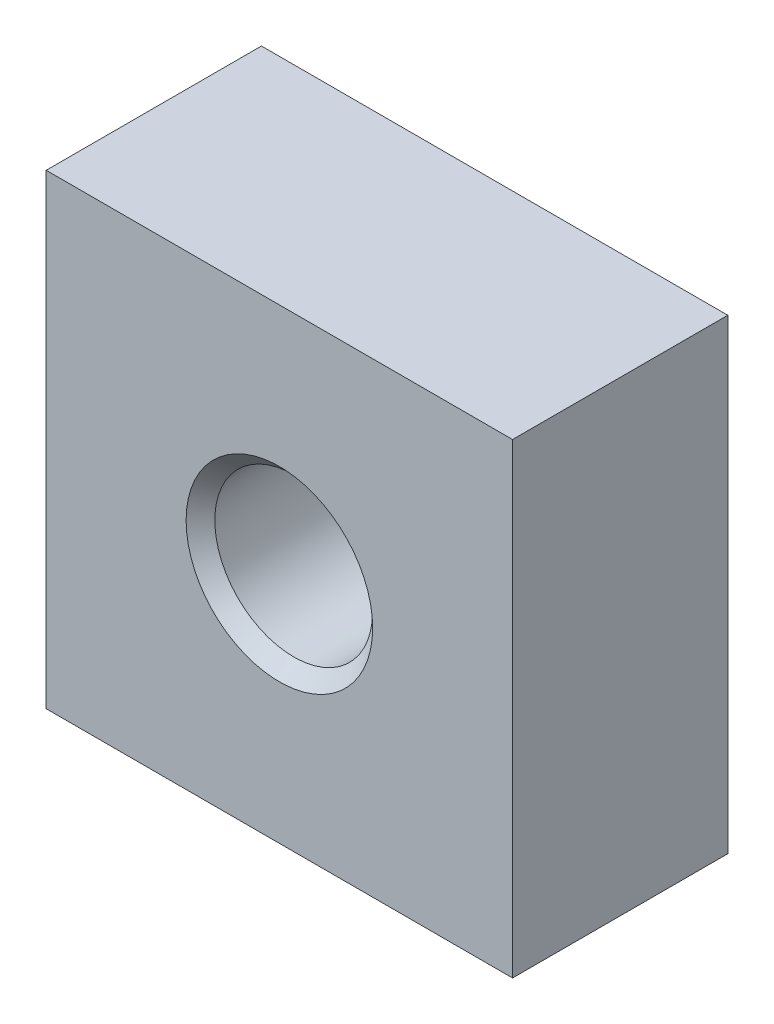
ISO-10303-21;
HEADER;
FILE_DESCRIPTION(('STEP AP214'),'2;1');
FILE_NAME('part.step','',(''),(''),'','','');
FILE_SCHEMA(('AUTOMOTIVE_DESIGN { 1 0 10303 214 1 1 1 1 }'));
ENDSEC;
DATA;
#1=APPLICATION_CONTEXT('core data for automotive mechanical design processes');
#2=APPLICATION_PROTOCOL_DEFINITION('international standard','automotive_design',2000,#1);
#3=PRODUCT_CONTEXT('',#1,'mechanical');
#4=PRODUCT('Part','Part','',(#3));
#5=PRODUCT_RELATED_PRODUCT_CATEGORY('part','',(#4));
#6=PRODUCT_DEFINITION_FORMATION('','',#4);
#7=PRODUCT_DEFINITION_CONTEXT('part definition',#1,'design');
#8=PRODUCT_DEFINITION('design','',#6,#7);
#9=PRODUCT_DEFINITION_SHAPE('','',#8);
#10=(LENGTH_UNIT() NAMED_UNIT(*) SI_UNIT(.MILLI.,.METRE.));
#11=(NAMED_UNIT(*) PLANE_ANGLE_UNIT() SI_UNIT($,.RADIAN.));
#12=(NAMED_UNIT(*) SI_UNIT($,.STERADIAN.) SOLID_ANGLE_UNIT());
#13=UNCERTAINTY_MEASURE_WITH_UNIT(LENGTH_MEASURE(1.E-05),#10,'distance_accuracy_value','');
#14=(GEOMETRIC_REPRESENTATION_CONTEXT(3) GLOBAL_UNCERTAINTY_ASSIGNED_CONTEXT((#13)) GLOBAL_UNIT_ASSIGNED_CONTEXT((#10,
#11,#12)) REPRESENTATION_CONTEXT('',''));
#15=CARTESIAN_POINT('',(0.,0.,0.));
#16=DIRECTION('',(0.,0.,1.));
#17=DIRECTION('',(1.,0.,0.));
#18=AXIS2_PLACEMENT_3D('',#15,#16,#17);
#19=CARTESIAN_POINT('',(0.,0.,30.));
#20=DIRECTION('',(0.,0.,1.));
#21=DIRECTION('',(1.,0.,0.));
#22=AXIS2_PLACEMENT_3D('',#19,#20,#21);
#23=PLANE('',#22);
#24=CARTESIAN_POINT('',(0.,0.,30.));
#25=DIRECTION('',(0.,0.,1.));
#26=DIRECTION('',(1.,0.,0.));
#27=AXIS2_PLACEMENT_3D('',#24,#25,#26);
#28=CIRCLE('',#27,13.);
#29=CARTESIAN_POINT('',(13.,0.,30.));
#30=VERTEX_POINT('',#29);
#31=EDGE_CURVE('E11',#30,#30,#28,.F.);
#32=ORIENTED_EDGE('',*,*,#31,.T.);
#33=EDGE_LOOP('',(#32));
#34=FACE_BOUND('',#33,.T.);
#35=DIRECTION('',(0.,-1.,0.));
#36=VECTOR('',#35,1.);
#37=CARTESIAN_POINT('',(-32.5,-32.5,30.));
#38=LINE('',#37,#36);
#39=CARTESIAN_POINT('',(-32.5,32.5,30.));
#40=VERTEX_POINT('',#39);
#41=CARTESIAN_POINT('',(-32.5,-32.5,30.));
#42=VERTEX_POINT('',#41);
#43=EDGE_CURVE('E87',#40,#42,#38,.T.);
#44=ORIENTED_EDGE('',*,*,#43,.T.);
#45=DIRECTION('',(1.,0.,0.));
#46=VECTOR('',#45,1.);
#47=CARTESIAN_POINT('',(32.5,-32.5,30.));
#48=LINE('',#47,#46);
#49=CARTESIAN_POINT('',(32.5,-32.5,30.));
#50=VERTEX_POINT('',#49);
#51=EDGE_CURVE('E83',#42,#50,#48,.T.);
#52=ORIENTED_EDGE('',*,*,#51,.T.);
#53=DIRECTION('',(0.,1.,0.));
#54=VECTOR('',#53,1.);
#55=CARTESIAN_POINT('',(32.5,-32.5,30.));
#56=LINE('',#55,#54);
#57=CARTESIAN_POINT('',(32.5,32.5,30.));
#58=VERTEX_POINT('',#57);
#59=EDGE_CURVE('E85',#50,#58,#56,.T.);
#60=ORIENTED_EDGE('',*,*,#59,.T.);
#61=DIRECTION('',(-1.,0.,0.));
#62=VECTOR('',#61,1.);
#63=CARTESIAN_POINT('',(32.5,32.5,30.));
#64=LINE('',#63,#62);
#65=EDGE_CURVE('E52',#58,#40,#64,.T.);
#66=ORIENTED_EDGE('',*,*,#65,.T.);
#67=EDGE_LOOP('',(#44,#52,#60,#66));
#68=FACE_BOUND('',#67,.T.);
#69=ADVANCED_FACE('F35',(#34,#68),#23,.T.);
#70=CARTESIAN_POINT('',(0.,0.,0.));
#71=DIRECTION('',(0.,0.,1.));
#72=DIRECTION('',(1.,0.,0.));
#73=AXIS2_PLACEMENT_3D('',#70,#71,#72);
#74=PLANE('',#73);
#75=CARTESIAN_POINT('',(0.,0.,0.));
#76=DIRECTION('',(0.,0.,1.));
#77=DIRECTION('',(1.,0.,0.));
#78=AXIS2_PLACEMENT_3D('',#75,#76,#77);
#79=CIRCLE('',#78,13.);
#80=CARTESIAN_POINT('',(13.,0.,0.));
#81=VERTEX_POINT('',#80);
#82=EDGE_CURVE('E111',#81,#81,#79,.T.);
#83=ORIENTED_EDGE('',*,*,#82,.T.);
#84=EDGE_LOOP('',(#83));
#85=FACE_BOUND('',#84,.T.);
#86=DIRECTION('',(0.,-1.,0.));
#87=VECTOR('',#86,1.);
#88=CARTESIAN_POINT('',(-32.5,-32.5,0.));
#89=LINE('',#88,#87);
#90=CARTESIAN_POINT('',(-32.5,32.5,0.));
#91=VERTEX_POINT('',#90);
#92=CARTESIAN_POINT('',(-32.5,-32.5,0.));
#93=VERTEX_POINT('',#92);
#94=EDGE_CURVE('E102',#91,#93,#89,.T.);
#95=ORIENTED_EDGE('',*,*,#94,.F.);
#96=DIRECTION('',(-1.,0.,0.));
#97=VECTOR('',#96,1.);
#98=CARTESIAN_POINT('',(32.5,32.5,0.));
#99=LINE('',#98,#97);
#100=CARTESIAN_POINT('',(32.5,32.5,0.));
#101=VERTEX_POINT('',#100);
#102=EDGE_CURVE('E75',#101,#91,#99,.T.);
#103=ORIENTED_EDGE('',*,*,#102,.F.);
#104=DIRECTION('',(0.,1.,0.));
#105=VECTOR('',#104,1.);
#106=CARTESIAN_POINT('',(32.5,-32.5,0.));
#107=LINE('',#106,#105);
#108=CARTESIAN_POINT('',(32.5,-32.5,0.));
#109=VERTEX_POINT('',#108);
#110=EDGE_CURVE('E69',#109,#101,#107,.T.);
#111=ORIENTED_EDGE('',*,*,#110,.F.);
#112=DIRECTION('',(1.,0.,0.));
#113=VECTOR('',#112,1.);
#114=CARTESIAN_POINT('',(32.5,-32.5,0.));
#115=LINE('',#114,#113);
#116=EDGE_CURVE('E92',#93,#109,#115,.T.);
#117=ORIENTED_EDGE('',*,*,#116,.F.);
#118=EDGE_LOOP('',(#95,#103,#111,#117));
#119=FACE_BOUND('',#118,.T.);
#120=ADVANCED_FACE('F127',(#85,#119),#74,.F.);
#121=CARTESIAN_POINT('',(-32.5,-32.5,30.));
#122=DIRECTION('',(1.,0.,0.));
#123=DIRECTION('',(0.,0.,-1.));
#124=AXIS2_PLACEMENT_3D('',#121,#122,#123);
#125=PLANE('',#124);
#126=ORIENTED_EDGE('',*,*,#94,.T.);
#127=DIRECTION('',(0.,0.,-1.));
#128=VECTOR('',#127,1.);
#129=CARTESIAN_POINT('',(-32.5,-32.5,30.));
#130=LINE('',#129,#128);
#131=EDGE_CURVE('E93',#42,#93,#130,.T.);
#132=ORIENTED_EDGE('',*,*,#131,.F.);
#133=ORIENTED_EDGE('',*,*,#43,.F.);
#134=DIRECTION('',(0.,0.,-1.));
#135=VECTOR('',#134,1.);
#136=CARTESIAN_POINT('',(-32.5,32.5,30.));
#137=LINE('',#136,#135);
#138=EDGE_CURVE('E98',#40,#91,#137,.T.);
#139=ORIENTED_EDGE('',*,*,#138,.T.);
#140=EDGE_LOOP('',(#126,#132,#133,#139));
#141=FACE_BOUND('',#140,.T.);
#142=ADVANCED_FACE('F130',(#141),#125,.F.);
#143=CARTESIAN_POINT('',(32.5,-32.5,30.));
#144=DIRECTION('',(0.,1.,0.));
#145=DIRECTION('',(0.,0.,1.));
#146=AXIS2_PLACEMENT_3D('',#143,#144,#145);
#147=PLANE('',#146);
#148=ORIENTED_EDGE('',*,*,#116,.T.);
#149=DIRECTION('',(0.,0.,-1.));
#150=VECTOR('',#149,1.);
#151=CARTESIAN_POINT('',(32.5,-32.5,30.));
#152=LINE('',#151,#150);
#153=EDGE_CURVE('E90',#50,#109,#152,.T.);
#154=ORIENTED_EDGE('',*,*,#153,.F.);
#155=ORIENTED_EDGE('',*,*,#51,.F.);
#156=ORIENTED_EDGE('',*,*,#131,.T.);
#157=EDGE_LOOP('',(#148,#154,#155,#156));
#158=FACE_BOUND('',#157,.T.);
#159=ADVANCED_FACE('F91',(#158),#147,.F.);
#160=CARTESIAN_POINT('',(32.5,-32.5,30.));
#161=DIRECTION('',(-1.,0.,0.));
#162=DIRECTION('',(0.,0.,1.));
#163=AXIS2_PLACEMENT_3D('',#160,#161,#162);
#164=PLANE('',#163);
#165=ORIENTED_EDGE('',*,*,#110,.T.);
#166=DIRECTION('',(0.,0.,-1.));
#167=VECTOR('',#166,1.);
#168=CARTESIAN_POINT('',(32.5,32.5,30.));
#169=LINE('',#168,#167);
#170=EDGE_CURVE('E94',#58,#101,#169,.T.);
#171=ORIENTED_EDGE('',*,*,#170,.F.);
#172=ORIENTED_EDGE('',*,*,#59,.F.);
#173=ORIENTED_EDGE('',*,*,#153,.T.);
#174=EDGE_LOOP('',(#165,#171,#172,#173));
#175=FACE_BOUND('',#174,.T.);
#176=ADVANCED_FACE('F96',(#175),#164,.F.);
#177=CARTESIAN_POINT('',(32.5,32.5,30.));
#178=DIRECTION('',(0.,-1.,0.));
#179=DIRECTION('',(1.,0.,0.));
#180=AXIS2_PLACEMENT_3D('',#177,#178,#179);
#181=PLANE('',#180);
#182=ORIENTED_EDGE('',*,*,#102,.T.);
#183=ORIENTED_EDGE('',*,*,#138,.F.);
#184=ORIENTED_EDGE('',*,*,#65,.F.);
#185=ORIENTED_EDGE('',*,*,#170,.T.);
#186=EDGE_LOOP('',(#182,#183,#184,#185));
#187=FACE_BOUND('',#186,.T.);
#188=ADVANCED_FACE('F134',(#187),#181,.F.);
#189=CARTESIAN_POINT('',(0.,0.,30.));
#190=DIRECTION('',(0.,0.,-1.));
#191=DIRECTION('',(-1.,0.,0.));
#192=AXIS2_PLACEMENT_3D('',#189,#190,#191);
#193=CYLINDRICAL_SURFACE('',#192,11.);
#194=CARTESIAN_POINT('',(0.,0.,2.));
#195=DIRECTION('',(0.,0.,1.));
#196=DIRECTION('',(1.,0.,0.));
#197=AXIS2_PLACEMENT_3D('',#194,#195,#196);
#198=CIRCLE('',#197,11.);
#199=CARTESIAN_POINT('',(11.,0.,2.));
#200=VERTEX_POINT('',#199);
#201=EDGE_CURVE('E44',#200,#200,#198,.F.);
#202=ORIENTED_EDGE('',*,*,#201,.T.);
#203=EDGE_LOOP('',(#202));
#204=FACE_BOUND('',#203,.T.);
#205=CARTESIAN_POINT('',(0.,0.,28.));
#206=DIRECTION('',(0.,0.,1.));
#207=DIRECTION('',(1.,0.,0.));
#208=AXIS2_PLACEMENT_3D('',#205,#206,#207);
#209=CIRCLE('',#208,11.);
#210=CARTESIAN_POINT('',(11.,0.,28.));
#211=VERTEX_POINT('',#210);
#212=EDGE_CURVE('E114',#211,#211,#209,.T.);
#213=ORIENTED_EDGE('',*,*,#212,.T.);
#214=EDGE_LOOP('',(#213));
#215=FACE_BOUND('',#214,.T.);
#216=ADVANCED_FACE('F119',(#204,#215),#193,.F.);
#217=CARTESIAN_POINT('',(0.,0.,0.));
#218=DIRECTION('',(0.,0.,-1.));
#219=DIRECTION('',(-1.,0.,0.));
#220=AXIS2_PLACEMENT_3D('',#217,#218,#219);
#221=CONICAL_SURFACE('',#220,13.,0.785398163397444);
#222=ORIENTED_EDGE('',*,*,#201,.F.);
#223=EDGE_LOOP('',(#222));
#224=FACE_BOUND('',#223,.T.);
#225=ORIENTED_EDGE('',*,*,#82,.F.);
#226=EDGE_LOOP('',(#225));
#227=FACE_BOUND('',#226,.T.);
#228=ADVANCED_FACE('F122',(#224,#227),#221,.F.);
#229=CARTESIAN_POINT('',(0.,0.,28.));
#230=DIRECTION('',(0.,0.,1.));
#231=DIRECTION('',(1.,0.,0.));
#232=AXIS2_PLACEMENT_3D('',#229,#230,#231);
#233=CONICAL_SURFACE('',#232,11.,0.785398163397453);
#234=ORIENTED_EDGE('',*,*,#31,.F.);
#235=EDGE_LOOP('',(#234));
#236=FACE_BOUND('',#235,.T.);
#237=ORIENTED_EDGE('',*,*,#212,.F.);
#238=EDGE_LOOP('',(#237));
#239=FACE_BOUND('',#238,.T.);
#240=ADVANCED_FACE('F37',(#236,#239),#233,.F.);
#241=CLOSED_SHELL('',(#69,#120,#142,#159,#176,#188,#216,#228,#240));
#242=MANIFOLD_SOLID_BREP('B2',#241);
#243=ADVANCED_BREP_SHAPE_REPRESENTATION('',(#18,#242),#14);
#244=SHAPE_DEFINITION_REPRESENTATION(#9,#243);
ENDSEC;
END-ISO-10303-21;
